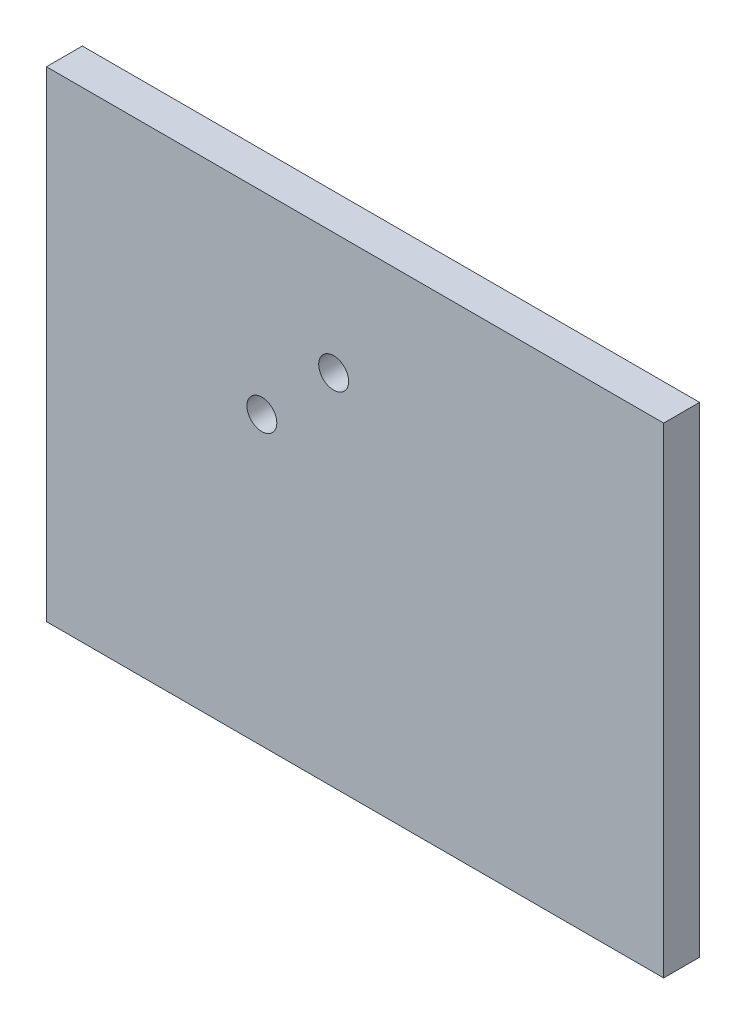
ISO-10303-21;
HEADER;
FILE_DESCRIPTION(('STEP AP214'),'2;1');
FILE_NAME('part.step','',(''),(''),'','','');
FILE_SCHEMA(('AUTOMOTIVE_DESIGN { 1 0 10303 214 1 1 1 1 }'));
ENDSEC;
DATA;
#1=APPLICATION_CONTEXT('core data for automotive mechanical design processes');
#2=APPLICATION_PROTOCOL_DEFINITION('international standard','automotive_design',2000,#1);
#3=PRODUCT_CONTEXT('',#1,'mechanical');
#4=PRODUCT('Part','Part','',(#3));
#5=PRODUCT_RELATED_PRODUCT_CATEGORY('part','',(#4));
#6=PRODUCT_DEFINITION_FORMATION('','',#4);
#7=PRODUCT_DEFINITION_CONTEXT('part definition',#1,'design');
#8=PRODUCT_DEFINITION('design','',#6,#7);
#9=PRODUCT_DEFINITION_SHAPE('','',#8);
#10=(LENGTH_UNIT() NAMED_UNIT(*) SI_UNIT(.MILLI.,.METRE.));
#11=(NAMED_UNIT(*) PLANE_ANGLE_UNIT() SI_UNIT($,.RADIAN.));
#12=(NAMED_UNIT(*) SI_UNIT($,.STERADIAN.) SOLID_ANGLE_UNIT());
#13=UNCERTAINTY_MEASURE_WITH_UNIT(LENGTH_MEASURE(1.E-05),#10,'distance_accuracy_value','');
#14=(GEOMETRIC_REPRESENTATION_CONTEXT(3) GLOBAL_UNCERTAINTY_ASSIGNED_CONTEXT((#13)) GLOBAL_UNIT_ASSIGNED_CONTEXT((#10,
#11,#12)) REPRESENTATION_CONTEXT('',''));
#15=CARTESIAN_POINT('',(0.,0.,0.));
#16=DIRECTION('',(0.,0.,1.));
#17=DIRECTION('',(1.,0.,0.));
#18=AXIS2_PLACEMENT_3D('',#15,#16,#17);
#19=CARTESIAN_POINT('',(85.9563831059381,-66.9268854064643,10.));
#20=DIRECTION('',(-1.,0.,0.));
#21=DIRECTION('',(0.,0.,1.));
#22=AXIS2_PLACEMENT_3D('',#19,#20,#21);
#23=PLANE('',#22);
#24=DIRECTION('',(0.,1.,0.));
#25=VECTOR('',#24,1.);
#26=CARTESIAN_POINT('',(85.9563831059381,-66.9268854064643,0.));
#27=LINE('',#26,#25);
#28=CARTESIAN_POINT('',(85.9563831059381,-66.9268854064643,0.));
#29=VERTEX_POINT('',#28);
#30=CARTESIAN_POINT('',(85.9563831059381,66.9268854064643,0.));
#31=VERTEX_POINT('',#30);
#32=EDGE_CURVE('E96',#29,#31,#27,.T.);
#33=ORIENTED_EDGE('',*,*,#32,.T.);
#34=DIRECTION('',(0.,0.,-1.));
#35=VECTOR('',#34,1.);
#36=CARTESIAN_POINT('',(85.9563831059381,66.9268854064643,10.));
#37=LINE('',#36,#35);
#38=CARTESIAN_POINT('',(85.9563831059381,66.9268854064643,10.));
#39=VERTEX_POINT('',#38);
#40=EDGE_CURVE('E11',#39,#31,#37,.T.);
#41=ORIENTED_EDGE('',*,*,#40,.F.);
#42=DIRECTION('',(0.,1.,0.));
#43=VECTOR('',#42,1.);
#44=CARTESIAN_POINT('',(85.9563831059381,-66.9268854064643,10.));
#45=LINE('',#44,#43);
#46=CARTESIAN_POINT('',(85.9563831059381,-66.9268854064643,10.));
#47=VERTEX_POINT('',#46);
#48=EDGE_CURVE('E84',#47,#39,#45,.T.);
#49=ORIENTED_EDGE('',*,*,#48,.F.);
#50=DIRECTION('',(0.,0.,-1.));
#51=VECTOR('',#50,1.);
#52=CARTESIAN_POINT('',(85.9563831059381,-66.9268854064643,10.));
#53=LINE('',#52,#51);
#54=EDGE_CURVE('E92',#47,#29,#53,.T.);
#55=ORIENTED_EDGE('',*,*,#54,.T.);
#56=EDGE_LOOP('',(#33,#41,#49,#55));
#57=FACE_BOUND('',#56,.T.);
#58=ADVANCED_FACE('F33',(#57),#23,.F.);
#59=CARTESIAN_POINT('',(-85.9563831059381,66.9268854064643,10.));
#60=DIRECTION('',(0.,-1.,0.));
#61=DIRECTION('',(0.,0.,-1.));
#62=AXIS2_PLACEMENT_3D('',#59,#60,#61);
#63=PLANE('',#62);
#64=DIRECTION('',(-1.,0.,0.));
#65=VECTOR('',#64,1.);
#66=CARTESIAN_POINT('',(-85.9563831059381,66.9268854064643,0.));
#67=LINE('',#66,#65);
#68=CARTESIAN_POINT('',(-85.9563831059381,66.9268854064643,0.));
#69=VERTEX_POINT('',#68);
#70=EDGE_CURVE('E88',#31,#69,#67,.T.);
#71=ORIENTED_EDGE('',*,*,#70,.T.);
#72=DIRECTION('',(0.,0.,-1.));
#73=VECTOR('',#72,1.);
#74=CARTESIAN_POINT('',(-85.9563831059381,66.9268854064643,10.));
#75=LINE('',#74,#73);
#76=CARTESIAN_POINT('',(-85.9563831059381,66.9268854064643,10.));
#77=VERTEX_POINT('',#76);
#78=EDGE_CURVE('E41',#77,#69,#75,.T.);
#79=ORIENTED_EDGE('',*,*,#78,.F.);
#80=DIRECTION('',(-1.,0.,0.));
#81=VECTOR('',#80,1.);
#82=CARTESIAN_POINT('',(-85.9563831059381,66.9268854064643,10.));
#83=LINE('',#82,#81);
#84=EDGE_CURVE('E79',#39,#77,#83,.T.);
#85=ORIENTED_EDGE('',*,*,#84,.F.);
#86=ORIENTED_EDGE('',*,*,#40,.T.);
#87=EDGE_LOOP('',(#71,#79,#85,#86));
#88=FACE_BOUND('',#87,.T.);
#89=ADVANCED_FACE('F87',(#88),#63,.F.);
#90=CARTESIAN_POINT('',(-85.9563831059381,-66.9268854064643,10.));
#91=DIRECTION('',(1.,0.,0.));
#92=DIRECTION('',(0.,0.,-1.));
#93=AXIS2_PLACEMENT_3D('',#90,#91,#92);
#94=PLANE('',#93);
#95=DIRECTION('',(0.,-1.,0.));
#96=VECTOR('',#95,1.);
#97=CARTESIAN_POINT('',(-85.9563831059381,-66.9268854064643,0.));
#98=LINE('',#97,#96);
#99=CARTESIAN_POINT('',(-85.9563831059381,-66.9268854064643,0.));
#100=VERTEX_POINT('',#99);
#101=EDGE_CURVE('E66',#69,#100,#98,.T.);
#102=ORIENTED_EDGE('',*,*,#101,.T.);
#103=DIRECTION('',(0.,0.,-1.));
#104=VECTOR('',#103,1.);
#105=CARTESIAN_POINT('',(-85.9563831059381,-66.9268854064643,10.));
#106=LINE('',#105,#104);
#107=CARTESIAN_POINT('',(-85.9563831059381,-66.9268854064643,10.));
#108=VERTEX_POINT('',#107);
#109=EDGE_CURVE('E89',#108,#100,#106,.T.);
#110=ORIENTED_EDGE('',*,*,#109,.F.);
#111=DIRECTION('',(0.,-1.,0.));
#112=VECTOR('',#111,1.);
#113=CARTESIAN_POINT('',(-85.9563831059381,-66.9268854064643,10.));
#114=LINE('',#113,#112);
#115=EDGE_CURVE('E82',#77,#108,#114,.T.);
#116=ORIENTED_EDGE('',*,*,#115,.F.);
#117=ORIENTED_EDGE('',*,*,#78,.T.);
#118=EDGE_LOOP('',(#102,#110,#116,#117));
#119=FACE_BOUND('',#118,.T.);
#120=ADVANCED_FACE('F90',(#119),#94,.F.);
#121=CARTESIAN_POINT('',(-85.9563831059381,-66.9268854064643,10.));
#122=DIRECTION('',(0.,1.,0.));
#123=DIRECTION('',(0.,0.,1.));
#124=AXIS2_PLACEMENT_3D('',#121,#122,#123);
#125=PLANE('',#124);
#126=DIRECTION('',(1.,0.,0.));
#127=VECTOR('',#126,1.);
#128=CARTESIAN_POINT('',(-85.9563831059381,-66.9268854064643,0.));
#129=LINE('',#128,#127);
#130=EDGE_CURVE('E72',#100,#29,#129,.T.);
#131=ORIENTED_EDGE('',*,*,#130,.T.);
#132=ORIENTED_EDGE('',*,*,#54,.F.);
#133=DIRECTION('',(1.,0.,0.));
#134=VECTOR('',#133,1.);
#135=CARTESIAN_POINT('',(-85.9563831059381,-66.9268854064643,10.));
#136=LINE('',#135,#134);
#137=EDGE_CURVE('E49',#108,#47,#136,.T.);
#138=ORIENTED_EDGE('',*,*,#137,.F.);
#139=ORIENTED_EDGE('',*,*,#109,.T.);
#140=EDGE_LOOP('',(#131,#132,#138,#139));
#141=FACE_BOUND('',#140,.T.);
#142=ADVANCED_FACE('F104',(#141),#125,.F.);
#143=CARTESIAN_POINT('',(0.,0.,10.));
#144=DIRECTION('',(0.,0.,-1.));
#145=DIRECTION('',(-1.,0.,0.));
#146=AXIS2_PLACEMENT_3D('',#143,#144,#145);
#147=PLANE('',#146);
#148=CARTESIAN_POINT('',(-5.95638310593806,33.0731145935358,10.));
#149=DIRECTION('',(0.,0.,1.));
#150=DIRECTION('',(1.,0.,0.));
#151=AXIS2_PLACEMENT_3D('',#148,#149,#150);
#152=CIRCLE('',#151,4.16341360907242);
#153=CARTESIAN_POINT('',(-1.79296949686564,33.0731145935358,10.));
#154=VERTEX_POINT('',#153);
#155=EDGE_CURVE('E116',#154,#154,#152,.T.);
#156=ORIENTED_EDGE('',*,*,#155,.F.);
#157=EDGE_LOOP('',(#156));
#158=FACE_BOUND('',#157,.T.);
#159=CARTESIAN_POINT('',(-25.9563831059381,13.0731145935358,10.));
#160=DIRECTION('',(0.,0.,1.));
#161=DIRECTION('',(1.,0.,0.));
#162=AXIS2_PLACEMENT_3D('',#159,#160,#161);
#163=CIRCLE('',#162,4.16341360907242);
#164=CARTESIAN_POINT('',(-21.7929694968656,13.0731145935358,10.));
#165=VERTEX_POINT('',#164);
#166=EDGE_CURVE('E110',#165,#165,#163,.T.);
#167=ORIENTED_EDGE('',*,*,#166,.F.);
#168=EDGE_LOOP('',(#167));
#169=FACE_BOUND('',#168,.T.);
#170=ORIENTED_EDGE('',*,*,#48,.T.);
#171=ORIENTED_EDGE('',*,*,#84,.T.);
#172=ORIENTED_EDGE('',*,*,#115,.T.);
#173=ORIENTED_EDGE('',*,*,#137,.T.);
#174=EDGE_LOOP('',(#170,#171,#172,#173));
#175=FACE_BOUND('',#174,.T.);
#176=ADVANCED_FACE('F80',(#158,#169,#175),#147,.F.);
#177=CARTESIAN_POINT('',(0.,0.,0.));
#178=DIRECTION('',(0.,0.,-1.));
#179=DIRECTION('',(-1.,0.,0.));
#180=AXIS2_PLACEMENT_3D('',#177,#178,#179);
#181=PLANE('',#180);
#182=CARTESIAN_POINT('',(-5.95638310593806,33.0731145935358,0.));
#183=DIRECTION('',(0.,0.,1.));
#184=DIRECTION('',(1.,0.,0.));
#185=AXIS2_PLACEMENT_3D('',#182,#183,#184);
#186=CIRCLE('',#185,4.16341360907242);
#187=CARTESIAN_POINT('',(-1.79296949686564,33.0731145935358,0.));
#188=VERTEX_POINT('',#187);
#189=EDGE_CURVE('E113',#188,#188,#186,.T.);
#190=ORIENTED_EDGE('',*,*,#189,.T.);
#191=EDGE_LOOP('',(#190));
#192=FACE_BOUND('',#191,.T.);
#193=CARTESIAN_POINT('',(-25.9563831059381,13.0731145935358,0.));
#194=DIRECTION('',(0.,0.,1.));
#195=DIRECTION('',(1.,0.,0.));
#196=AXIS2_PLACEMENT_3D('',#193,#194,#195);
#197=CIRCLE('',#196,4.16341360907242);
#198=CARTESIAN_POINT('',(-21.7929694968656,13.0731145935358,0.));
#199=VERTEX_POINT('',#198);
#200=EDGE_CURVE('E99',#199,#199,#197,.T.);
#201=ORIENTED_EDGE('',*,*,#200,.T.);
#202=EDGE_LOOP('',(#201));
#203=FACE_BOUND('',#202,.T.);
#204=ORIENTED_EDGE('',*,*,#32,.F.);
#205=ORIENTED_EDGE('',*,*,#130,.F.);
#206=ORIENTED_EDGE('',*,*,#101,.F.);
#207=ORIENTED_EDGE('',*,*,#70,.F.);
#208=EDGE_LOOP('',(#204,#205,#206,#207));
#209=FACE_BOUND('',#208,.T.);
#210=ADVANCED_FACE('F107',(#192,#203,#209),#181,.T.);
#211=CARTESIAN_POINT('',(-25.9563831059381,13.0731145935358,0.));
#212=DIRECTION('',(0.,0.,1.));
#213=DIRECTION('',(1.,0.,0.));
#214=AXIS2_PLACEMENT_3D('',#211,#212,#213);
#215=CYLINDRICAL_SURFACE('',#214,4.16341360907242);
#216=ORIENTED_EDGE('',*,*,#200,.F.);
#217=EDGE_LOOP('',(#216));
#218=FACE_BOUND('',#217,.T.);
#219=ORIENTED_EDGE('',*,*,#166,.T.);
#220=EDGE_LOOP('',(#219));
#221=FACE_BOUND('',#220,.T.);
#222=ADVANCED_FACE('F127',(#218,#221),#215,.F.);
#223=CARTESIAN_POINT('',(-5.95638310593806,33.0731145935358,0.));
#224=DIRECTION('',(0.,0.,1.));
#225=DIRECTION('',(1.,0.,0.));
#226=AXIS2_PLACEMENT_3D('',#223,#224,#225);
#227=CYLINDRICAL_SURFACE('',#226,4.16341360907242);
#228=ORIENTED_EDGE('',*,*,#189,.F.);
#229=EDGE_LOOP('',(#228));
#230=FACE_BOUND('',#229,.T.);
#231=ORIENTED_EDGE('',*,*,#155,.T.);
#232=EDGE_LOOP('',(#231));
#233=FACE_BOUND('',#232,.T.);
#234=ADVANCED_FACE('F124',(#230,#233),#227,.F.);
#235=CLOSED_SHELL('',(#58,#89,#120,#142,#176,#210,#222,#234));
#236=MANIFOLD_SOLID_BREP('B2',#235);
#237=ADVANCED_BREP_SHAPE_REPRESENTATION('',(#18,#236),#14);
#238=SHAPE_DEFINITION_REPRESENTATION(#9,#237);
ENDSEC;
END-ISO-10303-21;
